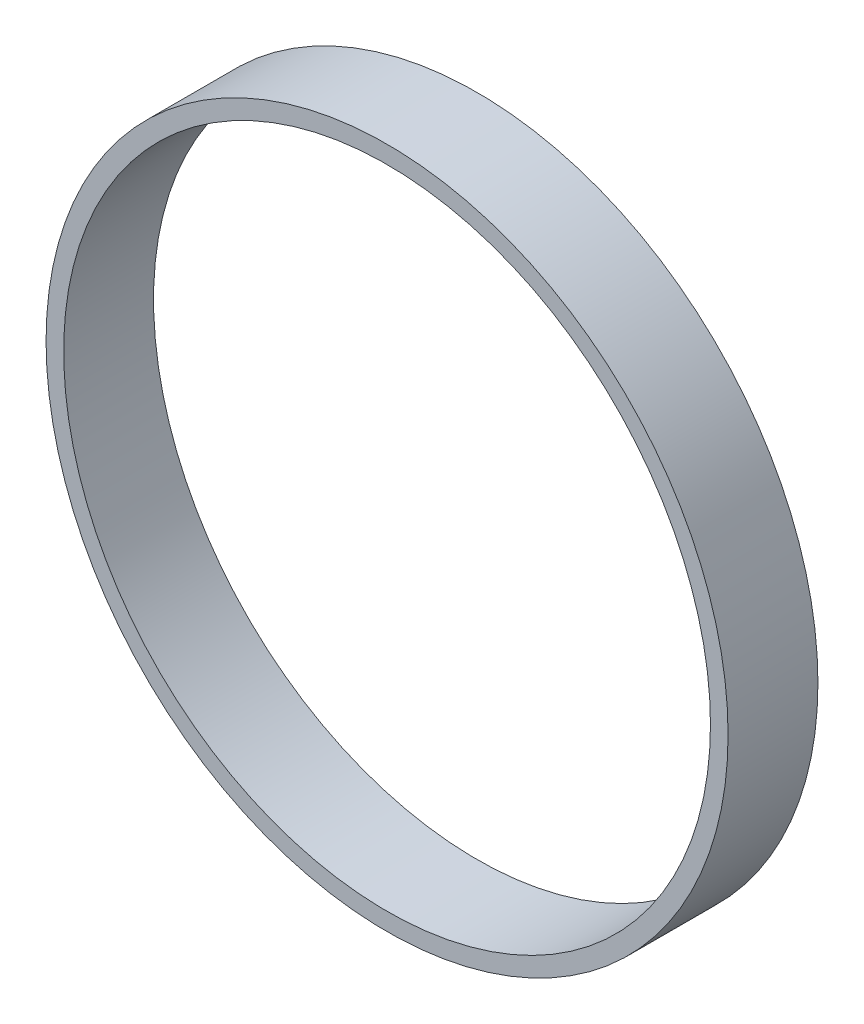
ISO-10303-21;
HEADER;
FILE_DESCRIPTION(('STEP AP214'),'2;1');
FILE_NAME('part.step','',(''),(''),'','','');
FILE_SCHEMA(('AUTOMOTIVE_DESIGN { 1 0 10303 214 1 1 1 1 }'));
ENDSEC;
DATA;
#1=APPLICATION_CONTEXT('core data for automotive mechanical design processes');
#2=APPLICATION_PROTOCOL_DEFINITION('international standard','automotive_design',2000,#1);
#3=PRODUCT_CONTEXT('',#1,'mechanical');
#4=PRODUCT('Part','Part','',(#3));
#5=PRODUCT_RELATED_PRODUCT_CATEGORY('part','',(#4));
#6=PRODUCT_DEFINITION_FORMATION('','',#4);
#7=PRODUCT_DEFINITION_CONTEXT('part definition',#1,'design');
#8=PRODUCT_DEFINITION('design','',#6,#7);
#9=PRODUCT_DEFINITION_SHAPE('','',#8);
#10=(LENGTH_UNIT() NAMED_UNIT(*) SI_UNIT(.MILLI.,.METRE.));
#11=(NAMED_UNIT(*) PLANE_ANGLE_UNIT() SI_UNIT($,.RADIAN.));
#12=(NAMED_UNIT(*) SI_UNIT($,.STERADIAN.) SOLID_ANGLE_UNIT());
#13=UNCERTAINTY_MEASURE_WITH_UNIT(LENGTH_MEASURE(1.E-05),#10,'distance_accuracy_value','');
#14=(GEOMETRIC_REPRESENTATION_CONTEXT(3) GLOBAL_UNCERTAINTY_ASSIGNED_CONTEXT((#13)) GLOBAL_UNIT_ASSIGNED_CONTEXT((#10,
#11,#12)) REPRESENTATION_CONTEXT('',''));
#15=CARTESIAN_POINT('',(0.,0.,0.));
#16=DIRECTION('',(0.,0.,1.));
#17=DIRECTION('',(1.,0.,0.));
#18=AXIS2_PLACEMENT_3D('',#15,#16,#17);
#19=CARTESIAN_POINT('',(0.,0.,10.));
#20=DIRECTION('',(0.,0.,1.));
#21=DIRECTION('',(1.,0.,0.));
#22=AXIS2_PLACEMENT_3D('',#19,#20,#21);
#23=PLANE('',#22);
#24=CARTESIAN_POINT('',(0.,0.,10.));
#25=DIRECTION('',(0.,0.,1.));
#26=DIRECTION('',(1.,0.,0.));
#27=AXIS2_PLACEMENT_3D('',#24,#25,#26);
#28=CIRCLE('',#27,37.95);
#29=CARTESIAN_POINT('',(37.95,0.,10.));
#30=VERTEX_POINT('',#29);
#31=EDGE_CURVE('E10',#30,#30,#28,.T.);
#32=ORIENTED_EDGE('',*,*,#31,.T.);
#33=EDGE_LOOP('',(#32));
#34=FACE_BOUND('',#33,.T.);
#35=CARTESIAN_POINT('',(0.,0.,10.));
#36=DIRECTION('',(0.,0.,1.));
#37=DIRECTION('',(1.,0.,0.));
#38=AXIS2_PLACEMENT_3D('',#35,#36,#37);
#39=CIRCLE('',#38,35.99);
#40=CARTESIAN_POINT('',(35.99,0.,10.));
#41=VERTEX_POINT('',#40);
#42=EDGE_CURVE('E49',#41,#41,#39,.T.);
#43=ORIENTED_EDGE('',*,*,#42,.F.);
#44=EDGE_LOOP('',(#43));
#45=FACE_BOUND('',#44,.T.);
#46=ADVANCED_FACE('F38',(#34,#45),#23,.T.);
#47=CARTESIAN_POINT('',(0.,0.,0.));
#48=DIRECTION('',(0.,0.,1.));
#49=DIRECTION('',(1.,0.,0.));
#50=AXIS2_PLACEMENT_3D('',#47,#48,#49);
#51=PLANE('',#50);
#52=CARTESIAN_POINT('',(0.,0.,0.));
#53=DIRECTION('',(0.,0.,1.));
#54=DIRECTION('',(1.,0.,0.));
#55=AXIS2_PLACEMENT_3D('',#52,#53,#54);
#56=CIRCLE('',#55,37.95);
#57=CARTESIAN_POINT('',(37.95,0.,0.));
#58=VERTEX_POINT('',#57);
#59=EDGE_CURVE('E42',#58,#58,#56,.T.);
#60=ORIENTED_EDGE('',*,*,#59,.F.);
#61=EDGE_LOOP('',(#60));
#62=FACE_BOUND('',#61,.T.);
#63=CARTESIAN_POINT('',(0.,0.,0.));
#64=DIRECTION('',(0.,0.,1.));
#65=DIRECTION('',(1.,0.,0.));
#66=AXIS2_PLACEMENT_3D('',#63,#64,#65);
#67=CIRCLE('',#66,35.99);
#68=CARTESIAN_POINT('',(35.99,0.,0.));
#69=VERTEX_POINT('',#68);
#70=EDGE_CURVE('E51',#69,#69,#67,.T.);
#71=ORIENTED_EDGE('',*,*,#70,.T.);
#72=EDGE_LOOP('',(#71));
#73=FACE_BOUND('',#72,.T.);
#74=ADVANCED_FACE('F61',(#62,#73),#51,.F.);
#75=CARTESIAN_POINT('',(0.,0.,10.));
#76=DIRECTION('',(0.,0.,-1.));
#77=DIRECTION('',(-1.,0.,0.));
#78=AXIS2_PLACEMENT_3D('',#75,#76,#77);
#79=CYLINDRICAL_SURFACE('',#78,37.95);
#80=ORIENTED_EDGE('',*,*,#31,.F.);
#81=EDGE_LOOP('',(#80));
#82=FACE_BOUND('',#81,.T.);
#83=ORIENTED_EDGE('',*,*,#59,.T.);
#84=EDGE_LOOP('',(#83));
#85=FACE_BOUND('',#84,.T.);
#86=ADVANCED_FACE('F40',(#82,#85),#79,.T.);
#87=CARTESIAN_POINT('',(0.,0.,10.));
#88=DIRECTION('',(0.,0.,-1.));
#89=DIRECTION('',(-1.,0.,0.));
#90=AXIS2_PLACEMENT_3D('',#87,#88,#89);
#91=CYLINDRICAL_SURFACE('',#90,35.99);
#92=ORIENTED_EDGE('',*,*,#42,.T.);
#93=EDGE_LOOP('',(#92));
#94=FACE_BOUND('',#93,.T.);
#95=ORIENTED_EDGE('',*,*,#70,.F.);
#96=EDGE_LOOP('',(#95));
#97=FACE_BOUND('',#96,.T.);
#98=ADVANCED_FACE('F57',(#94,#97),#91,.F.);
#99=CLOSED_SHELL('',(#46,#74,#86,#98));
#100=MANIFOLD_SOLID_BREP('B2',#99);
#101=ADVANCED_BREP_SHAPE_REPRESENTATION('',(#18,#100),#14);
#102=SHAPE_DEFINITION_REPRESENTATION(#9,#101);
ENDSEC;
END-ISO-10303-21;
